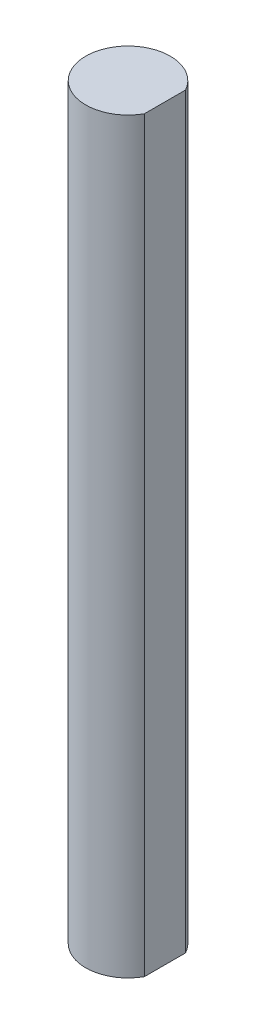
ISO-10303-21;
HEADER;
FILE_DESCRIPTION(('STEP AP214'),'2;1');
FILE_NAME('part.step','',(''),(''),'','','');
FILE_SCHEMA(('AUTOMOTIVE_DESIGN { 1 0 10303 214 1 1 1 1 }'));
ENDSEC;
DATA;
#1=APPLICATION_CONTEXT('core data for automotive mechanical design processes');
#2=APPLICATION_PROTOCOL_DEFINITION('international standard','automotive_design',2000,#1);
#3=PRODUCT_CONTEXT('',#1,'mechanical');
#4=PRODUCT('Part','Part','',(#3));
#5=PRODUCT_RELATED_PRODUCT_CATEGORY('part','',(#4));
#6=PRODUCT_DEFINITION_FORMATION('','',#4);
#7=PRODUCT_DEFINITION_CONTEXT('part definition',#1,'design');
#8=PRODUCT_DEFINITION('design','',#6,#7);
#9=PRODUCT_DEFINITION_SHAPE('','',#8);
#10=(LENGTH_UNIT() NAMED_UNIT(*) SI_UNIT(.MILLI.,.METRE.));
#11=(NAMED_UNIT(*) PLANE_ANGLE_UNIT() SI_UNIT($,.RADIAN.));
#12=(NAMED_UNIT(*) SI_UNIT($,.STERADIAN.) SOLID_ANGLE_UNIT());
#13=UNCERTAINTY_MEASURE_WITH_UNIT(LENGTH_MEASURE(1.E-05),#10,'distance_accuracy_value','');
#14=(GEOMETRIC_REPRESENTATION_CONTEXT(3) GLOBAL_UNCERTAINTY_ASSIGNED_CONTEXT((#13)) GLOBAL_UNIT_ASSIGNED_CONTEXT((#10,
#11,#12)) REPRESENTATION_CONTEXT('',''));
#15=CARTESIAN_POINT('',(0.,0.,0.));
#16=DIRECTION('',(0.,0.,1.));
#17=DIRECTION('',(1.,0.,0.));
#18=AXIS2_PLACEMENT_3D('',#15,#16,#17);
#19=CARTESIAN_POINT('',(0.,50.8,0.));
#20=DIRECTION('',(0.,-1.,0.));
#21=DIRECTION('',(0.,0.,-1.));
#22=AXIS2_PLACEMENT_3D('',#19,#20,#21);
#23=CYLINDRICAL_SURFACE('',#22,2.875);
#24=CARTESIAN_POINT('',(0.,0.,0.));
#25=DIRECTION('',(0.,1.,0.));
#26=DIRECTION('',(0.,0.,1.));
#27=AXIS2_PLACEMENT_3D('',#24,#25,#26);
#28=CIRCLE('',#27,2.875);
#29=CARTESIAN_POINT('',(2.51164321561393,0.,-1.3990258601829));
#30=VERTEX_POINT('',#29);
#31=CARTESIAN_POINT('',(2.51164321561393,0.,1.3990258601829));
#32=VERTEX_POINT('',#31);
#33=EDGE_CURVE('E72',#30,#32,#28,.T.);
#34=ORIENTED_EDGE('',*,*,#33,.T.);
#35=DIRECTION('',(0.,-1.,0.));
#36=VECTOR('',#35,1.);
#37=CARTESIAN_POINT('',(2.51164321561393,50.8,1.3990258601829));
#38=LINE('',#37,#36);
#39=CARTESIAN_POINT('',(2.51164321561393,50.8,1.3990258601829));
#40=VERTEX_POINT('',#39);
#41=EDGE_CURVE('E11',#40,#32,#38,.T.);
#42=ORIENTED_EDGE('',*,*,#41,.F.);
#43=CARTESIAN_POINT('',(0.,50.8,0.));
#44=DIRECTION('',(0.,1.,0.));
#45=DIRECTION('',(0.,0.,1.));
#46=AXIS2_PLACEMENT_3D('',#43,#44,#45);
#47=CIRCLE('',#46,2.875);
#48=CARTESIAN_POINT('',(2.51164321561393,50.8,-1.3990258601829));
#49=VERTEX_POINT('',#48);
#50=EDGE_CURVE('E71',#49,#40,#47,.T.);
#51=ORIENTED_EDGE('',*,*,#50,.F.);
#52=DIRECTION('',(0.,-1.,0.));
#53=VECTOR('',#52,1.);
#54=CARTESIAN_POINT('',(2.51164321561393,50.8,-1.3990258601829));
#55=LINE('',#54,#53);
#56=EDGE_CURVE('E48',#49,#30,#55,.T.);
#57=ORIENTED_EDGE('',*,*,#56,.T.);
#58=EDGE_LOOP('',(#34,#42,#51,#57));
#59=FACE_BOUND('',#58,.T.);
#60=ADVANCED_FACE('F39',(#59),#23,.T.);
#61=CARTESIAN_POINT('',(2.51164321561393,50.8,-1.3990258601829));
#62=DIRECTION('',(-1.,0.,0.));
#63=DIRECTION('',(0.,0.,1.));
#64=AXIS2_PLACEMENT_3D('',#61,#62,#63);
#65=PLANE('',#64);
#66=DIRECTION('',(0.,0.,-1.));
#67=VECTOR('',#66,1.);
#68=CARTESIAN_POINT('',(2.51164321561393,0.,-1.3990258601829));
#69=LINE('',#68,#67);
#70=EDGE_CURVE('E63',#32,#30,#69,.T.);
#71=ORIENTED_EDGE('',*,*,#70,.T.);
#72=ORIENTED_EDGE('',*,*,#56,.F.);
#73=DIRECTION('',(0.,0.,-1.));
#74=VECTOR('',#73,1.);
#75=CARTESIAN_POINT('',(2.51164321561393,50.8,-1.3990258601829));
#76=LINE('',#75,#74);
#77=EDGE_CURVE('E55',#40,#49,#76,.T.);
#78=ORIENTED_EDGE('',*,*,#77,.F.);
#79=ORIENTED_EDGE('',*,*,#41,.T.);
#80=EDGE_LOOP('',(#71,#72,#78,#79));
#81=FACE_BOUND('',#80,.T.);
#82=ADVANCED_FACE('F66',(#81),#65,.F.);
#83=CARTESIAN_POINT('',(0.,50.8,0.));
#84=DIRECTION('',(0.,1.,0.));
#85=DIRECTION('',(0.,0.,1.));
#86=AXIS2_PLACEMENT_3D('',#83,#84,#85);
#87=PLANE('',#86);
#88=ORIENTED_EDGE('',*,*,#50,.T.);
#89=ORIENTED_EDGE('',*,*,#77,.T.);
#90=EDGE_LOOP('',(#88,#89));
#91=FACE_BOUND('',#90,.T.);
#92=ADVANCED_FACE('F83',(#91),#87,.T.);
#93=CARTESIAN_POINT('',(0.,0.,0.));
#94=DIRECTION('',(0.,1.,0.));
#95=DIRECTION('',(0.,0.,1.));
#96=AXIS2_PLACEMENT_3D('',#93,#94,#95);
#97=PLANE('',#96);
#98=ORIENTED_EDGE('',*,*,#33,.F.);
#99=ORIENTED_EDGE('',*,*,#70,.F.);
#100=EDGE_LOOP('',(#98,#99));
#101=FACE_BOUND('',#100,.T.);
#102=ADVANCED_FACE('F76',(#101),#97,.F.);
#103=CLOSED_SHELL('',(#60,#82,#92,#102));
#104=MANIFOLD_SOLID_BREP('B2',#103);
#105=ADVANCED_BREP_SHAPE_REPRESENTATION('',(#18,#104),#14);
#106=SHAPE_DEFINITION_REPRESENTATION(#9,#105);
ENDSEC;
END-ISO-10303-21;
